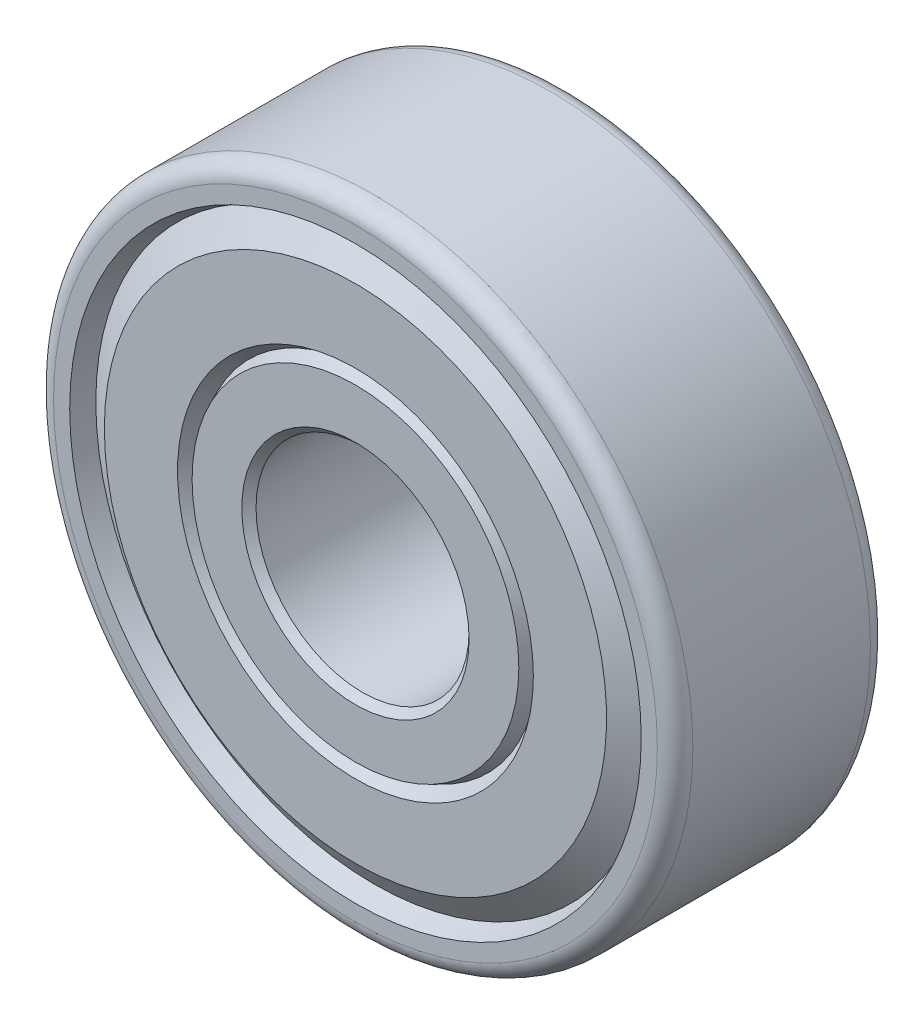
ISO-10303-21;
HEADER;
FILE_DESCRIPTION(('STEP AP214'),'2;1');
FILE_NAME('part.step','',(''),(''),'','','');
FILE_SCHEMA(('AUTOMOTIVE_DESIGN { 1 0 10303 214 1 1 1 1 }'));
ENDSEC;
DATA;
#1=APPLICATION_CONTEXT('core data for automotive mechanical design processes');
#2=APPLICATION_PROTOCOL_DEFINITION('international standard','automotive_design',2000,#1);
#3=PRODUCT_CONTEXT('',#1,'mechanical');
#4=PRODUCT('Part','Part','',(#3));
#5=PRODUCT_RELATED_PRODUCT_CATEGORY('part','',(#4));
#6=PRODUCT_DEFINITION_FORMATION('','',#4);
#7=PRODUCT_DEFINITION_CONTEXT('part definition',#1,'design');
#8=PRODUCT_DEFINITION('design','',#6,#7);
#9=PRODUCT_DEFINITION_SHAPE('','',#8);
#10=(LENGTH_UNIT() NAMED_UNIT(*) SI_UNIT(.MILLI.,.METRE.));
#11=(NAMED_UNIT(*) PLANE_ANGLE_UNIT() SI_UNIT($,.RADIAN.));
#12=(NAMED_UNIT(*) SI_UNIT($,.STERADIAN.) SOLID_ANGLE_UNIT());
#13=UNCERTAINTY_MEASURE_WITH_UNIT(LENGTH_MEASURE(1.E-05),#10,'distance_accuracy_value','');
#14=(GEOMETRIC_REPRESENTATION_CONTEXT(3) GLOBAL_UNCERTAINTY_ASSIGNED_CONTEXT((#13)) GLOBAL_UNIT_ASSIGNED_CONTEXT((#10,
#11,#12)) REPRESENTATION_CONTEXT('',''));
#15=CARTESIAN_POINT('',(0.,0.,0.));
#16=DIRECTION('',(0.,0.,1.));
#17=DIRECTION('',(1.,0.,0.));
#18=AXIS2_PLACEMENT_3D('',#15,#16,#17);
#19=CARTESIAN_POINT('',(0.,0.,0.));
#20=DIRECTION('',(0.,0.,1.));
#21=DIRECTION('',(1.,0.,0.));
#22=AXIS2_PLACEMENT_3D('',#19,#20,#21);
#23=CYLINDRICAL_SURFACE('',#22,4.7625);
#24=CARTESIAN_POINT('',(0.,0.,-4.44499999991876));
#25=DIRECTION('',(0.,0.,-1.));
#26=DIRECTION('',(-1.,0.,0.));
#27=AXIS2_PLACEMENT_3D('',#24,#25,#26);
#28=CIRCLE('',#27,4.76250000014034);
#29=CARTESIAN_POINT('',(-4.76250000014034,0.,-4.44499999991876));
#30=VERTEX_POINT('',#29);
#31=EDGE_CURVE('E334',#30,#30,#28,.T.);
#32=ORIENTED_EDGE('',*,*,#31,.T.);
#33=EDGE_LOOP('',(#32));
#34=FACE_BOUND('',#33,.T.);
#35=CARTESIAN_POINT('',(0.,0.,4.44499999997561));
#36=DIRECTION('',(0.,0.,1.));
#37=DIRECTION('',(1.,0.,0.));
#38=AXIS2_PLACEMENT_3D('',#35,#36,#37);
#39=CIRCLE('',#38,4.76250000025402);
#40=CARTESIAN_POINT('',(4.76250000025402,0.,4.44499999997561));
#41=VERTEX_POINT('',#40);
#42=EDGE_CURVE('E365',#41,#41,#39,.T.);
#43=ORIENTED_EDGE('',*,*,#42,.T.);
#44=EDGE_LOOP('',(#43));
#45=FACE_BOUND('',#44,.T.);
#46=ADVANCED_FACE('F17',(#34,#45),#23,.F.);
#47=CARTESIAN_POINT('',(0.,0.,-4.76250000019718));
#48=DIRECTION('',(0.,0.,-1.));
#49=DIRECTION('',(-1.,0.,0.));
#50=AXIS2_PLACEMENT_3D('',#47,#48,#49);
#51=CONICAL_SURFACE('',#50,5.07999999985032,0.785398162502276);
#52=ORIENTED_EDGE('',*,*,#31,.F.);
#53=EDGE_LOOP('',(#52));
#54=FACE_BOUND('',#53,.T.);
#55=CARTESIAN_POINT('',(0.,0.,-4.76250000019718));
#56=DIRECTION('',(0.,0.,-1.));
#57=DIRECTION('',(-1.,0.,0.));
#58=AXIS2_PLACEMENT_3D('',#55,#56,#57);
#59=CIRCLE('',#58,5.07999999985032);
#60=CARTESIAN_POINT('',(-5.07999999985032,0.,-4.76250000019718));
#61=VERTEX_POINT('',#60);
#62=EDGE_CURVE('E363',#61,#61,#59,.F.);
#63=ORIENTED_EDGE('',*,*,#62,.F.);
#64=EDGE_LOOP('',(#63));
#65=FACE_BOUND('',#64,.T.);
#66=ADVANCED_FACE('F176',(#54,#65),#51,.F.);
#67=CARTESIAN_POINT('',(0.,0.,4.76250000019718));
#68=DIRECTION('',(0.,0.,1.));
#69=DIRECTION('',(1.,0.,0.));
#70=AXIS2_PLACEMENT_3D('',#67,#68,#69);
#71=CONICAL_SURFACE('',#70,5.07999999985032,0.785398162502276);
#72=ORIENTED_EDGE('',*,*,#42,.F.);
#73=EDGE_LOOP('',(#72));
#74=FACE_BOUND('',#73,.T.);
#75=CARTESIAN_POINT('',(0.,0.,4.76250000019718));
#76=DIRECTION('',(0.,0.,1.));
#77=DIRECTION('',(1.,0.,0.));
#78=AXIS2_PLACEMENT_3D('',#75,#76,#77);
#79=CIRCLE('',#78,5.07999999985032);
#80=CARTESIAN_POINT('',(5.07999999985032,0.,4.76250000019718));
#81=VERTEX_POINT('',#80);
#82=EDGE_CURVE('E360',#81,#81,#79,.T.);
#83=ORIENTED_EDGE('',*,*,#82,.T.);
#84=EDGE_LOOP('',(#83));
#85=FACE_BOUND('',#84,.T.);
#86=ADVANCED_FACE('F173',(#74,#85),#71,.F.);
#87=CARTESIAN_POINT('',(0.,0.,-4.7625));
#88=DIRECTION('',(0.,0.,-1.));
#89=DIRECTION('',(-1.,0.,0.));
#90=AXIS2_PLACEMENT_3D('',#87,#88,#89);
#91=PLANE('',#90);
#92=ORIENTED_EDGE('',*,*,#62,.T.);
#93=EDGE_LOOP('',(#92));
#94=FACE_BOUND('',#93,.T.);
#95=CARTESIAN_POINT('',(0.,0.,-4.76249999991989));
#96=DIRECTION('',(0.,0.,1.));
#97=DIRECTION('',(1.,0.,0.));
#98=AXIS2_PLACEMENT_3D('',#95,#96,#97);
#99=CIRCLE('',#98,7.30250000003462);
#100=CARTESIAN_POINT('',(7.30250000003462,0.,-4.76249999991989));
#101=VERTEX_POINT('',#100);
#102=EDGE_CURVE('E357',#101,#101,#99,.T.);
#103=ORIENTED_EDGE('',*,*,#102,.F.);
#104=EDGE_LOOP('',(#103));
#105=FACE_BOUND('',#104,.T.);
#106=ADVANCED_FACE('F169',(#94,#105),#91,.T.);
#107=CARTESIAN_POINT('',(0.,0.,4.7625));
#108=DIRECTION('',(0.,0.,-1.));
#109=DIRECTION('',(-1.,0.,0.));
#110=AXIS2_PLACEMENT_3D('',#107,#108,#109);
#111=PLANE('',#110);
#112=ORIENTED_EDGE('',*,*,#82,.F.);
#113=EDGE_LOOP('',(#112));
#114=FACE_BOUND('',#113,.T.);
#115=CARTESIAN_POINT('',(0.,0.,4.76250000005775));
#116=DIRECTION('',(0.,0.,-1.));
#117=DIRECTION('',(-1.,0.,0.));
#118=AXIS2_PLACEMENT_3D('',#115,#116,#117);
#119=CIRCLE('',#118,7.30250000013478);
#120=CARTESIAN_POINT('',(-7.30250000013478,0.,4.76250000005775));
#121=VERTEX_POINT('',#120);
#122=EDGE_CURVE('E353',#121,#121,#119,.T.);
#123=ORIENTED_EDGE('',*,*,#122,.F.);
#124=EDGE_LOOP('',(#123));
#125=FACE_BOUND('',#124,.T.);
#126=ADVANCED_FACE('F165',(#114,#125),#111,.F.);
#127=CARTESIAN_POINT('',(0.,0.,-4.18132890088095));
#128=DIRECTION('',(0.,0.,1.));
#129=DIRECTION('',(1.,0.,0.));
#130=AXIS2_PLACEMENT_3D('',#127,#128,#129);
#131=CONICAL_SURFACE('',#130,7.55365742462221,0.407917424825);
#132=ORIENTED_EDGE('',*,*,#102,.T.);
#133=EDGE_LOOP('',(#132));
#134=FACE_BOUND('',#133,.T.);
#135=CARTESIAN_POINT('',(0.,0.,-4.18132890088));
#136=DIRECTION('',(0.,0.,-1.));
#137=DIRECTION('',(-1.,0.,0.));
#138=AXIS2_PLACEMENT_3D('',#135,#136,#137);
#139=CIRCLE('',#138,7.55365742462);
#140=CARTESIAN_POINT('',(-7.55365742462,0.,-4.18132890088));
#141=VERTEX_POINT('',#140);
#142=EDGE_CURVE('E356',#141,#141,#139,.T.);
#143=ORIENTED_EDGE('',*,*,#142,.T.);
#144=EDGE_LOOP('',(#143));
#145=FACE_BOUND('',#144,.T.);
#146=ADVANCED_FACE('F161',(#134,#145),#131,.T.);
#147=CARTESIAN_POINT('',(0.,0.,4.18132890081861));
#148=DIRECTION('',(0.,0.,-1.));
#149=DIRECTION('',(-1.,0.,0.));
#150=AXIS2_PLACEMENT_3D('',#147,#148,#149);
#151=CONICAL_SURFACE('',#150,7.55365742448679,0.407917424358);
#152=ORIENTED_EDGE('',*,*,#122,.T.);
#153=EDGE_LOOP('',(#152));
#154=FACE_BOUND('',#153,.T.);
#155=CARTESIAN_POINT('',(0.,0.,4.18132890063774));
#156=DIRECTION('',(0.,0.,1.));
#157=DIRECTION('',(1.,0.,0.));
#158=AXIS2_PLACEMENT_3D('',#155,#156,#157);
#159=CIRCLE('',#158,7.55365742475582);
#160=CARTESIAN_POINT('',(7.55365742475582,0.,4.18132890063774));
#161=VERTEX_POINT('',#160);
#162=EDGE_CURVE('E352',#161,#161,#159,.T.);
#163=ORIENTED_EDGE('',*,*,#162,.T.);
#164=EDGE_LOOP('',(#163));
#165=FACE_BOUND('',#164,.T.);
#166=ADVANCED_FACE('F157',(#154,#165),#151,.T.);
#167=CARTESIAN_POINT('',(0.,0.,-4.76250000000321));
#168=DIRECTION('',(0.,0.,-1.));
#169=DIRECTION('',(-1.,0.,0.));
#170=AXIS2_PLACEMENT_3D('',#167,#168,#169);
#171=CONICAL_SURFACE('',#170,7.95213697292532,0.601029540805);
#172=ORIENTED_EDGE('',*,*,#142,.F.);
#173=EDGE_LOOP('',(#172));
#174=FACE_BOUND('',#173,.T.);
#175=CARTESIAN_POINT('',(0.,0.,-4.76250000000321));
#176=DIRECTION('',(0.,0.,-1.));
#177=DIRECTION('',(-1.,0.,0.));
#178=AXIS2_PLACEMENT_3D('',#175,#176,#177);
#179=CIRCLE('',#178,7.95213697292532);
#180=CARTESIAN_POINT('',(-7.95213697292532,0.,-4.76250000000321));
#181=VERTEX_POINT('',#180);
#182=EDGE_CURVE('E349',#181,#181,#179,.F.);
#183=ORIENTED_EDGE('',*,*,#182,.F.);
#184=EDGE_LOOP('',(#183));
#185=FACE_BOUND('',#184,.T.);
#186=ADVANCED_FACE('F153',(#174,#185),#171,.F.);
#187=CARTESIAN_POINT('',(0.,0.,4.7625000001381));
#188=DIRECTION('',(0.,0.,1.));
#189=DIRECTION('',(1.,0.,0.));
#190=AXIS2_PLACEMENT_3D('',#187,#188,#189);
#191=CONICAL_SURFACE('',#190,7.95213697273277,0.601029540118001);
#192=ORIENTED_EDGE('',*,*,#162,.F.);
#193=EDGE_LOOP('',(#192));
#194=FACE_BOUND('',#193,.T.);
#195=CARTESIAN_POINT('',(0.,0.,4.7625000001381));
#196=DIRECTION('',(0.,0.,1.));
#197=DIRECTION('',(1.,0.,0.));
#198=AXIS2_PLACEMENT_3D('',#195,#196,#197);
#199=CIRCLE('',#198,7.95213697273277);
#200=CARTESIAN_POINT('',(7.95213697273277,0.,4.7625000001381));
#201=VERTEX_POINT('',#200);
#202=EDGE_CURVE('E346',#201,#201,#199,.T.);
#203=ORIENTED_EDGE('',*,*,#202,.T.);
#204=EDGE_LOOP('',(#203));
#205=FACE_BOUND('',#204,.T.);
#206=ADVANCED_FACE('F149',(#194,#205),#191,.F.);
#207=CARTESIAN_POINT('',(0.,0.,-4.7625));
#208=DIRECTION('',(0.,0.,-1.));
#209=DIRECTION('',(-1.,0.,0.));
#210=AXIS2_PLACEMENT_3D('',#207,#208,#209);
#211=PLANE('',#210);
#212=ORIENTED_EDGE('',*,*,#182,.T.);
#213=EDGE_LOOP('',(#212));
#214=FACE_BOUND('',#213,.T.);
#215=CARTESIAN_POINT('',(0.,0.,-4.7625));
#216=DIRECTION('',(0.,0.,1.));
#217=DIRECTION('',(1.,0.,0.));
#218=AXIS2_PLACEMENT_3D('',#215,#216,#217);
#219=CIRCLE('',#218,11.2241326943);
#220=CARTESIAN_POINT('',(11.2241326943,0.,-4.7625));
#221=VERTEX_POINT('',#220);
#222=EDGE_CURVE('E343',#221,#221,#219,.T.);
#223=ORIENTED_EDGE('',*,*,#222,.F.);
#224=EDGE_LOOP('',(#223));
#225=FACE_BOUND('',#224,.T.);
#226=ADVANCED_FACE('F145',(#214,#225),#211,.T.);
#227=CARTESIAN_POINT('',(0.,0.,4.7625));
#228=DIRECTION('',(0.,0.,-1.));
#229=DIRECTION('',(-1.,0.,0.));
#230=AXIS2_PLACEMENT_3D('',#227,#228,#229);
#231=PLANE('',#230);
#232=ORIENTED_EDGE('',*,*,#202,.F.);
#233=EDGE_LOOP('',(#232));
#234=FACE_BOUND('',#233,.T.);
#235=CARTESIAN_POINT('',(0.,0.,4.76250000066659));
#236=DIRECTION('',(0.,0.,-1.));
#237=DIRECTION('',(-1.,0.,0.));
#238=AXIS2_PLACEMENT_3D('',#235,#236,#237);
#239=CIRCLE('',#238,11.2241326947977);
#240=CARTESIAN_POINT('',(-11.2241326947977,0.,4.76250000066659));
#241=VERTEX_POINT('',#240);
#242=EDGE_CURVE('E339',#241,#241,#239,.T.);
#243=ORIENTED_EDGE('',*,*,#242,.F.);
#244=EDGE_LOOP('',(#243));
#245=FACE_BOUND('',#244,.T.);
#246=ADVANCED_FACE('F141',(#234,#245),#231,.F.);
#247=CARTESIAN_POINT('',(0.,0.,-3.93017144223398));
#248=DIRECTION('',(0.,0.,1.));
#249=DIRECTION('',(1.,0.,0.));
#250=AXIS2_PLACEMENT_3D('',#247,#248,#249);
#251=CONICAL_SURFACE('',#250,12.4380602466822,0.96976678599);
#252=ORIENTED_EDGE('',*,*,#222,.T.);
#253=EDGE_LOOP('',(#252));
#254=FACE_BOUND('',#253,.T.);
#255=CARTESIAN_POINT('',(0.,0.,-3.93017144226));
#256=DIRECTION('',(0.,0.,-1.));
#257=DIRECTION('',(-1.,0.,0.));
#258=AXIS2_PLACEMENT_3D('',#255,#256,#257);
#259=CIRCLE('',#258,12.4380602467);
#260=CARTESIAN_POINT('',(-12.4380602467,0.,-3.93017144226));
#261=VERTEX_POINT('',#260);
#262=EDGE_CURVE('E342',#261,#261,#259,.T.);
#263=ORIENTED_EDGE('',*,*,#262,.T.);
#264=EDGE_LOOP('',(#263));
#265=FACE_BOUND('',#264,.T.);
#266=ADVANCED_FACE('F137',(#254,#265),#251,.T.);
#267=CARTESIAN_POINT('',(0.,0.,3.93017144159342));
#268=DIRECTION('',(0.,0.,-1.));
#269=DIRECTION('',(-1.,0.,0.));
#270=AXIS2_PLACEMENT_3D('',#267,#268,#269);
#271=CONICAL_SURFACE('',#270,12.4380602462023,0.969766784882);
#272=ORIENTED_EDGE('',*,*,#242,.T.);
#273=EDGE_LOOP('',(#272));
#274=FACE_BOUND('',#273,.T.);
#275=CARTESIAN_POINT('',(0.,0.,3.9301714414307));
#276=DIRECTION('',(0.,0.,1.));
#277=DIRECTION('',(1.,0.,0.));
#278=AXIS2_PLACEMENT_3D('',#275,#276,#277);
#279=CIRCLE('',#278,12.4380602465959);
#280=CARTESIAN_POINT('',(12.4380602465959,0.,3.93017144143071));
#281=VERTEX_POINT('',#280);
#282=EDGE_CURVE('E338',#281,#281,#279,.T.);
#283=ORIENTED_EDGE('',*,*,#282,.T.);
#284=EDGE_LOOP('',(#283));
#285=FACE_BOUND('',#284,.T.);
#286=ADVANCED_FACE('F133',(#274,#285),#271,.T.);
#287=CARTESIAN_POINT('',(0.,0.,-4.76250000001232));
#288=DIRECTION('',(0.,0.,-1.));
#289=DIRECTION('',(-1.,0.,0.));
#290=AXIS2_PLACEMENT_3D('',#287,#288,#289);
#291=CONICAL_SURFACE('',#290,12.7729368128694,0.382519398269);
#292=ORIENTED_EDGE('',*,*,#262,.F.);
#293=EDGE_LOOP('',(#292));
#294=FACE_BOUND('',#293,.T.);
#295=CARTESIAN_POINT('',(0.,0.,-4.76250000001232));
#296=DIRECTION('',(0.,0.,-1.));
#297=DIRECTION('',(-1.,0.,0.));
#298=AXIS2_PLACEMENT_3D('',#295,#296,#297);
#299=CIRCLE('',#298,12.7729368128694);
#300=CARTESIAN_POINT('',(-12.7729368128694,0.,-4.76250000001232));
#301=VERTEX_POINT('',#300);
#302=EDGE_CURVE('E52',#301,#301,#299,.F.);
#303=ORIENTED_EDGE('',*,*,#302,.F.);
#304=EDGE_LOOP('',(#303));
#305=FACE_BOUND('',#304,.T.);
#306=ADVANCED_FACE('F129',(#294,#305),#291,.F.);
#307=CARTESIAN_POINT('',(0.,0.,4.76250000028727));
#308=DIRECTION('',(0.,0.,1.));
#309=DIRECTION('',(1.,0.,0.));
#310=AXIS2_PLACEMENT_3D('',#307,#308,#309);
#311=CONICAL_SURFACE('',#310,12.772936812786,0.382519397830999);
#312=ORIENTED_EDGE('',*,*,#282,.F.);
#313=EDGE_LOOP('',(#312));
#314=FACE_BOUND('',#313,.T.);
#315=CARTESIAN_POINT('',(0.,0.,4.76250000028727));
#316=DIRECTION('',(0.,0.,1.));
#317=DIRECTION('',(1.,0.,0.));
#318=AXIS2_PLACEMENT_3D('',#315,#316,#317);
#319=CIRCLE('',#318,12.772936812786);
#320=CARTESIAN_POINT('',(12.772936812786,0.,4.76250000028727));
#321=VERTEX_POINT('',#320);
#322=EDGE_CURVE('E58',#321,#321,#319,.T.);
#323=ORIENTED_EDGE('',*,*,#322,.T.);
#324=EDGE_LOOP('',(#323));
#325=FACE_BOUND('',#324,.T.);
#326=ADVANCED_FACE('F124',(#314,#325),#311,.F.);
#327=CARTESIAN_POINT('',(0.,0.,-4.7625));
#328=DIRECTION('',(0.,0.,-1.));
#329=DIRECTION('',(-1.,0.,0.));
#330=AXIS2_PLACEMENT_3D('',#327,#328,#329);
#331=PLANE('',#330);
#332=ORIENTED_EDGE('',*,*,#302,.T.);
#333=EDGE_LOOP('',(#332));
#334=FACE_BOUND('',#333,.T.);
#335=CARTESIAN_POINT('',(0.,0.,-4.7625));
#336=DIRECTION('',(0.,0.,1.));
#337=DIRECTION('',(1.,0.,0.));
#338=AXIS2_PLACEMENT_3D('',#335,#336,#337);
#339=CIRCLE('',#338,13.49375);
#340=CARTESIAN_POINT('',(13.49375,0.,-4.7625));
#341=VERTEX_POINT('',#340);
#342=CARTESIAN_POINT('',(-13.49375,0.,-4.7625));
#343=VERTEX_POINT('',#342);
#344=EDGE_CURVE('E50',#341,#343,#339,.T.);
#345=ORIENTED_EDGE('',*,*,#344,.F.);
#346=CARTESIAN_POINT('',(0.,0.,-4.7625));
#347=DIRECTION('',(0.,0.,1.));
#348=DIRECTION('',(-1.,0.,0.));
#349=AXIS2_PLACEMENT_3D('',#346,#347,#348);
#350=CIRCLE('',#349,13.49375);
#351=EDGE_CURVE('E44',#343,#341,#350,.T.);
#352=ORIENTED_EDGE('',*,*,#351,.F.);
#353=EDGE_LOOP('',(#345,#352));
#354=FACE_BOUND('',#353,.T.);
#355=ADVANCED_FACE('F49',(#334,#354),#331,.T.);
#356=CARTESIAN_POINT('',(0.,0.,4.7625));
#357=DIRECTION('',(0.,0.,-1.));
#358=DIRECTION('',(-1.,0.,0.));
#359=AXIS2_PLACEMENT_3D('',#356,#357,#358);
#360=PLANE('',#359);
#361=ORIENTED_EDGE('',*,*,#322,.F.);
#362=EDGE_LOOP('',(#361));
#363=FACE_BOUND('',#362,.T.);
#364=CARTESIAN_POINT('',(0.,0.,4.7625));
#365=DIRECTION('',(0.,0.,-1.));
#366=DIRECTION('',(-1.,0.,0.));
#367=AXIS2_PLACEMENT_3D('',#364,#365,#366);
#368=CIRCLE('',#367,13.49375);
#369=CARTESIAN_POINT('',(-13.49375,0.,4.7625));
#370=VERTEX_POINT('',#369);
#371=CARTESIAN_POINT('',(13.49375,0.,4.7625));
#372=VERTEX_POINT('',#371);
#373=EDGE_CURVE('E57',#370,#372,#368,.T.);
#374=ORIENTED_EDGE('',*,*,#373,.F.);
#375=CARTESIAN_POINT('',(0.,0.,4.7625));
#376=DIRECTION('',(0.,0.,-1.));
#377=DIRECTION('',(1.,0.,0.));
#378=AXIS2_PLACEMENT_3D('',#375,#376,#377);
#379=CIRCLE('',#378,13.49375);
#380=EDGE_CURVE('E36',#372,#370,#379,.T.);
#381=ORIENTED_EDGE('',*,*,#380,.F.);
#382=EDGE_LOOP('',(#374,#381));
#383=FACE_BOUND('',#382,.T.);
#384=ADVANCED_FACE('F77',(#363,#383),#360,.F.);
#385=CARTESIAN_POINT('',(0.,0.,-3.96875));
#386=DIRECTION('',(0.,0.,1.));
#387=DIRECTION('',(1.,0.,0.));
#388=AXIS2_PLACEMENT_3D('',#385,#386,#387);
#389=TOROIDAL_SURFACE('',#388,13.49375,0.79375);
#390=CARTESIAN_POINT('',(0.,0.,-3.96875));
#391=DIRECTION('',(0.,0.,1.));
#392=DIRECTION('',(1.,0.,0.));
#393=AXIS2_PLACEMENT_3D('',#390,#391,#392);
#394=CIRCLE('',#393,14.2875);
#395=CARTESIAN_POINT('',(14.2875,0.,-3.96875));
#396=VERTEX_POINT('',#395);
#397=EDGE_CURVE('E28',#396,#396,#394,.T.);
#398=ORIENTED_EDGE('',*,*,#397,.F.);
#399=EDGE_LOOP('',(#398));
#400=FACE_BOUND('',#399,.T.);
#401=ORIENTED_EDGE('',*,*,#344,.T.);
#402=ORIENTED_EDGE('',*,*,#351,.T.);
#403=EDGE_LOOP('',(#401,#402));
#404=FACE_BOUND('',#403,.T.);
#405=ADVANCED_FACE('F56',(#400,#404),#389,.T.);
#406=CARTESIAN_POINT('',(0.,0.,3.96875));
#407=DIRECTION('',(0.,0.,-1.));
#408=DIRECTION('',(-1.,0.,0.));
#409=AXIS2_PLACEMENT_3D('',#406,#407,#408);
#410=TOROIDAL_SURFACE('',#409,13.49375,0.79375);
#411=CARTESIAN_POINT('',(0.,0.,3.96875));
#412=DIRECTION('',(0.,0.,1.));
#413=DIRECTION('',(1.,0.,0.));
#414=AXIS2_PLACEMENT_3D('',#411,#412,#413);
#415=CIRCLE('',#414,14.2875);
#416=CARTESIAN_POINT('',(14.2875,0.,3.96875));
#417=VERTEX_POINT('',#416);
#418=EDGE_CURVE('E11',#417,#417,#415,.F.);
#419=ORIENTED_EDGE('',*,*,#418,.F.);
#420=EDGE_LOOP('',(#419));
#421=FACE_BOUND('',#420,.T.);
#422=ORIENTED_EDGE('',*,*,#380,.T.);
#423=ORIENTED_EDGE('',*,*,#373,.T.);
#424=EDGE_LOOP('',(#422,#423));
#425=FACE_BOUND('',#424,.T.);
#426=ADVANCED_FACE('F76',(#421,#425),#410,.T.);
#427=CARTESIAN_POINT('',(0.,0.,0.));
#428=DIRECTION('',(0.,0.,1.));
#429=DIRECTION('',(1.,0.,0.));
#430=AXIS2_PLACEMENT_3D('',#427,#428,#429);
#431=CYLINDRICAL_SURFACE('',#430,14.2875);
#432=ORIENTED_EDGE('',*,*,#397,.T.);
#433=EDGE_LOOP('',(#432));
#434=FACE_BOUND('',#433,.T.);
#435=ORIENTED_EDGE('',*,*,#418,.T.);
#436=EDGE_LOOP('',(#435));
#437=FACE_BOUND('',#436,.T.);
#438=ADVANCED_FACE('F187',(#434,#437),#431,.T.);
#439=CLOSED_SHELL('',(#46,#66,#86,#106,#126,#146,#166,#186,#206,#226,#246,#266,#286,#306,#326,
#355,#384,#405,#426,#438));
#440=MANIFOLD_SOLID_BREP('B1',#439);
#441=ADVANCED_BREP_SHAPE_REPRESENTATION('',(#18,#440),#14);
#442=SHAPE_DEFINITION_REPRESENTATION(#9,#441);
ENDSEC;
END-ISO-10303-21;
